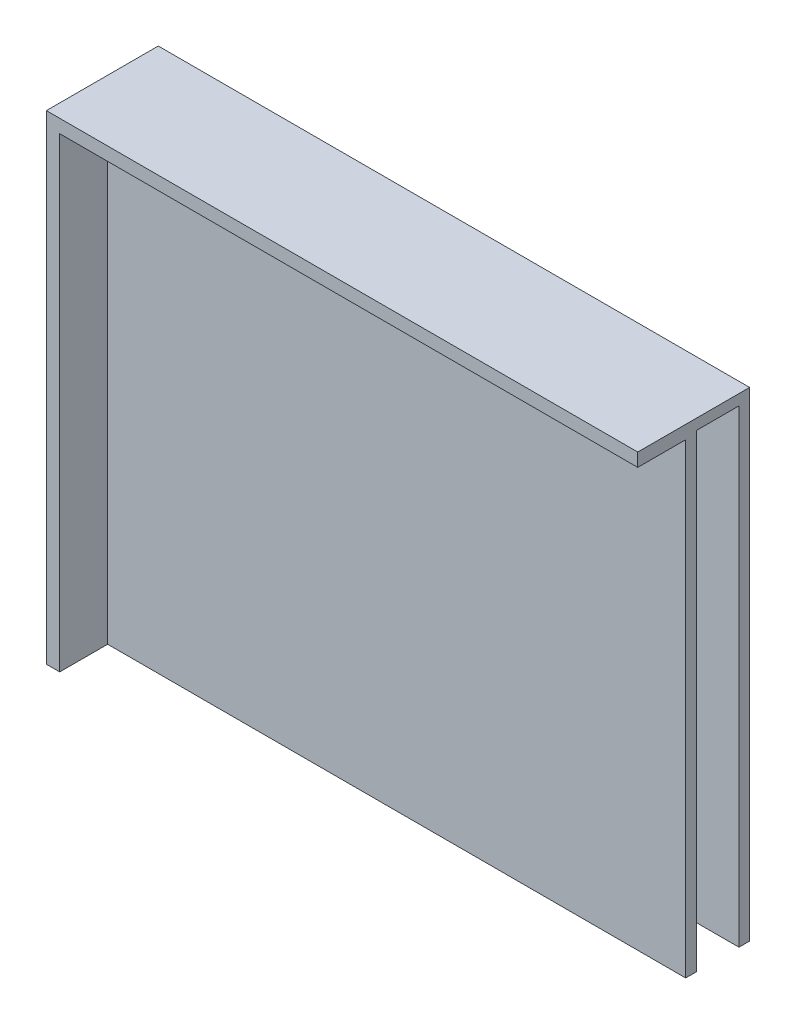
ISO-10303-21;
HEADER;
FILE_DESCRIPTION(('STEP AP214'),'2;1');
FILE_NAME('part.step','',(''),(''),'','','');
FILE_SCHEMA(('AUTOMOTIVE_DESIGN { 1 0 10303 214 1 1 1 1 }'));
ENDSEC;
DATA;
#1=APPLICATION_CONTEXT('core data for automotive mechanical design processes');
#2=APPLICATION_PROTOCOL_DEFINITION('international standard','automotive_design',2000,#1);
#3=PRODUCT_CONTEXT('',#1,'mechanical');
#4=PRODUCT('Part','Part','',(#3));
#5=PRODUCT_RELATED_PRODUCT_CATEGORY('part','',(#4));
#6=PRODUCT_DEFINITION_FORMATION('','',#4);
#7=PRODUCT_DEFINITION_CONTEXT('part definition',#1,'design');
#8=PRODUCT_DEFINITION('design','',#6,#7);
#9=PRODUCT_DEFINITION_SHAPE('','',#8);
#10=(LENGTH_UNIT() NAMED_UNIT(*) SI_UNIT(.MILLI.,.METRE.));
#11=(NAMED_UNIT(*) PLANE_ANGLE_UNIT() SI_UNIT($,.RADIAN.));
#12=(NAMED_UNIT(*) SI_UNIT($,.STERADIAN.) SOLID_ANGLE_UNIT());
#13=UNCERTAINTY_MEASURE_WITH_UNIT(LENGTH_MEASURE(1.E-05),#10,'distance_accuracy_value','');
#14=(GEOMETRIC_REPRESENTATION_CONTEXT(3) GLOBAL_UNCERTAINTY_ASSIGNED_CONTEXT((#13)) GLOBAL_UNIT_ASSIGNED_CONTEXT((#10,
#11,#12)) REPRESENTATION_CONTEXT('',''));
#15=CARTESIAN_POINT('',(0.,0.,0.));
#16=DIRECTION('',(0.,0.,1.));
#17=DIRECTION('',(1.,0.,0.));
#18=AXIS2_PLACEMENT_3D('',#15,#16,#17);
#19=CARTESIAN_POINT('',(72.6068292682926,16.3396341463416,26.68));
#20=DIRECTION('',(0.,-1.,0.));
#21=DIRECTION('',(1.,0.,0.));
#22=AXIS2_PLACEMENT_3D('',#19,#20,#21);
#23=PLANE('',#22);
#24=DIRECTION('',(-1.,0.,0.));
#25=VECTOR('',#24,1.);
#26=CARTESIAN_POINT('',(0.,16.3396341463416,12.7));
#27=LINE('',#26,#25);
#28=CARTESIAN_POINT('',(72.6068292682926,16.3396341463416,12.7));
#29=VERTEX_POINT('',#28);
#30=CARTESIAN_POINT('',(-65.8231707317073,16.3396341463416,12.7));
#31=VERTEX_POINT('',#30);
#32=EDGE_CURVE('E136',#29,#31,#27,.T.);
#33=ORIENTED_EDGE('',*,*,#32,.F.);
#34=DIRECTION('',(0.,0.,-1.));
#35=VECTOR('',#34,1.);
#36=CARTESIAN_POINT('',(72.6068292682926,16.3396341463416,26.68));
#37=LINE('',#36,#35);
#38=CARTESIAN_POINT('',(72.6068292682926,16.3396341463416,15.24));
#39=VERTEX_POINT('',#38);
#40=EDGE_CURVE('E137',#39,#29,#37,.T.);
#41=ORIENTED_EDGE('',*,*,#40,.F.);
#42=DIRECTION('',(-1.,0.,0.));
#43=VECTOR('',#42,1.);
#44=CARTESIAN_POINT('',(0.,16.3396341463416,15.24));
#45=LINE('',#44,#43);
#46=CARTESIAN_POINT('',(-65.1881707317074,16.3396341463416,15.24));
#47=VERTEX_POINT('',#46);
#48=EDGE_CURVE('E142',#39,#47,#45,.T.);
#49=ORIENTED_EDGE('',*,*,#48,.T.);
#50=DIRECTION('',(0.,0.,-1.));
#51=VECTOR('',#50,1.);
#52=CARTESIAN_POINT('',(-65.1881707317074,16.3396341463416,0.));
#53=LINE('',#52,#51);
#54=CARTESIAN_POINT('',(-65.1881707317074,16.3396341463416,26.67));
#55=VERTEX_POINT('',#54);
#56=EDGE_CURVE('E194',#55,#47,#53,.T.);
#57=ORIENTED_EDGE('',*,*,#56,.F.);
#58=DIRECTION('',(1.,0.,0.));
#59=VECTOR('',#58,1.);
#60=CARTESIAN_POINT('',(0.,16.3396341463416,26.67));
#61=LINE('',#60,#59);
#62=CARTESIAN_POINT('',(-68.3631707317074,16.3396341463416,26.67));
#63=VERTEX_POINT('',#62);
#64=EDGE_CURVE('E153',#63,#55,#61,.T.);
#65=ORIENTED_EDGE('',*,*,#64,.F.);
#66=DIRECTION('',(0.,0.,1.));
#67=VECTOR('',#66,1.);
#68=CARTESIAN_POINT('',(-68.3631707317073,16.3396341463416,17.272));
#69=LINE('',#68,#67);
#70=CARTESIAN_POINT('',(-68.3631707317074,16.3396341463416,0.));
#71=VERTEX_POINT('',#70);
#72=EDGE_CURVE('E141',#71,#63,#69,.T.);
#73=ORIENTED_EDGE('',*,*,#72,.F.);
#74=DIRECTION('',(1.,0.,0.));
#75=VECTOR('',#74,1.);
#76=CARTESIAN_POINT('',(0.,16.3396341463416,0.));
#77=LINE('',#76,#75);
#78=CARTESIAN_POINT('',(72.6068292682926,16.3396341463416,0.));
#79=VERTEX_POINT('',#78);
#80=EDGE_CURVE('E125',#71,#79,#77,.T.);
#81=ORIENTED_EDGE('',*,*,#80,.T.);
#82=CARTESIAN_POINT('',(72.6068292682926,16.3396341463416,2.54));
#83=VERTEX_POINT('',#82);
#84=EDGE_CURVE('E131',#83,#79,#37,.T.);
#85=ORIENTED_EDGE('',*,*,#84,.F.);
#86=DIRECTION('',(1.,0.,0.));
#87=VECTOR('',#86,1.);
#88=CARTESIAN_POINT('',(0.,16.3396341463416,2.54));
#89=LINE('',#88,#87);
#90=CARTESIAN_POINT('',(-65.8231707317073,16.3396341463416,2.54));
#91=VERTEX_POINT('',#90);
#92=EDGE_CURVE('E197',#91,#83,#89,.T.);
#93=ORIENTED_EDGE('',*,*,#92,.F.);
#94=DIRECTION('',(0.,0.,1.));
#95=VECTOR('',#94,1.);
#96=CARTESIAN_POINT('',(-65.8231707317073,16.3396341463416,17.272));
#97=LINE('',#96,#95);
#98=EDGE_CURVE('E145',#91,#31,#97,.T.);
#99=ORIENTED_EDGE('',*,*,#98,.T.);
#100=EDGE_LOOP('',(#33,#41,#49,#57,#65,#73,#81,#85,#93,#99));
#101=FACE_BOUND('',#100,.T.);
#102=ADVANCED_FACE('F40',(#101),#23,.T.);
#103=CARTESIAN_POINT('',(72.6068292682926,130.639634146342,26.68));
#104=DIRECTION('',(1.,0.,0.));
#105=DIRECTION('',(0.,1.,0.));
#106=AXIS2_PLACEMENT_3D('',#103,#104,#105);
#107=PLANE('',#106);
#108=DIRECTION('',(0.,-1.,0.));
#109=VECTOR('',#108,1.);
#110=CARTESIAN_POINT('',(72.6068292682926,0.,15.24));
#111=LINE('',#110,#109);
#112=CARTESIAN_POINT('',(72.6068292682926,127.464634146342,15.24));
#113=VERTEX_POINT('',#112);
#114=EDGE_CURVE('E11',#113,#39,#111,.T.);
#115=ORIENTED_EDGE('',*,*,#114,.T.);
#116=ORIENTED_EDGE('',*,*,#40,.T.);
#117=DIRECTION('',(0.,-1.,0.));
#118=VECTOR('',#117,1.);
#119=CARTESIAN_POINT('',(72.6068292682926,0.,12.7));
#120=LINE('',#119,#118);
#121=CARTESIAN_POINT('',(72.6068292682926,128.099634146342,12.7));
#122=VERTEX_POINT('',#121);
#123=EDGE_CURVE('E169',#122,#29,#120,.T.);
#124=ORIENTED_EDGE('',*,*,#123,.F.);
#125=DIRECTION('',(0.,0.,1.));
#126=VECTOR('',#125,1.);
#127=CARTESIAN_POINT('',(72.6068292682926,128.099634146342,25.4));
#128=LINE('',#127,#126);
#129=CARTESIAN_POINT('',(72.6068292682926,128.099634146342,2.54));
#130=VERTEX_POINT('',#129);
#131=EDGE_CURVE('E173',#130,#122,#128,.T.);
#132=ORIENTED_EDGE('',*,*,#131,.F.);
#133=DIRECTION('',(0.,1.,0.));
#134=VECTOR('',#133,1.);
#135=CARTESIAN_POINT('',(72.6068292682926,0.,2.54));
#136=LINE('',#135,#134);
#137=EDGE_CURVE('E134',#83,#130,#136,.T.);
#138=ORIENTED_EDGE('',*,*,#137,.F.);
#139=ORIENTED_EDGE('',*,*,#84,.T.);
#140=DIRECTION('',(0.,1.,0.));
#141=VECTOR('',#140,1.);
#142=CARTESIAN_POINT('',(72.6068292682926,0.,0.));
#143=LINE('',#142,#141);
#144=CARTESIAN_POINT('',(72.6068292682926,130.639634146342,0.));
#145=VERTEX_POINT('',#144);
#146=EDGE_CURVE('E48',#79,#145,#143,.T.);
#147=ORIENTED_EDGE('',*,*,#146,.T.);
#148=DIRECTION('',(0.,0.,1.));
#149=VECTOR('',#148,1.);
#150=CARTESIAN_POINT('',(72.6068292682926,130.639634146342,25.4));
#151=LINE('',#150,#149);
#152=CARTESIAN_POINT('',(72.6068292682926,130.639634146342,26.67));
#153=VERTEX_POINT('',#152);
#154=EDGE_CURVE('E128',#145,#153,#151,.T.);
#155=ORIENTED_EDGE('',*,*,#154,.T.);
#156=DIRECTION('',(0.,1.,0.));
#157=VECTOR('',#156,1.);
#158=CARTESIAN_POINT('',(72.6068292682926,0.,26.67));
#159=LINE('',#158,#157);
#160=CARTESIAN_POINT('',(72.6068292682926,127.464634146342,26.67));
#161=VERTEX_POINT('',#160);
#162=EDGE_CURVE('E176',#161,#153,#159,.T.);
#163=ORIENTED_EDGE('',*,*,#162,.F.);
#164=DIRECTION('',(0.,0.,1.));
#165=VECTOR('',#164,1.);
#166=CARTESIAN_POINT('',(72.6068292682926,127.464634146342,0.));
#167=LINE('',#166,#165);
#168=EDGE_CURVE('E182',#113,#161,#167,.T.);
#169=ORIENTED_EDGE('',*,*,#168,.F.);
#170=EDGE_LOOP('',(#115,#116,#124,#132,#138,#139,#147,#155,#163,#169));
#171=FACE_BOUND('',#170,.T.);
#172=ADVANCED_FACE('F132',(#171),#107,.T.);
#173=CARTESIAN_POINT('',(-65.8231707317073,-94.7853658536585,17.272));
#174=DIRECTION('',(-1.,0.,0.));
#175=DIRECTION('',(0.,0.,1.));
#176=AXIS2_PLACEMENT_3D('',#173,#174,#175);
#177=PLANE('',#176);
#178=ORIENTED_EDGE('',*,*,#98,.F.);
#179=DIRECTION('',(0.,-1.,0.));
#180=VECTOR('',#179,1.);
#181=CARTESIAN_POINT('',(-65.8231707317073,0.,2.54));
#182=LINE('',#181,#180);
#183=CARTESIAN_POINT('',(-65.8231707317073,128.099634146342,2.54));
#184=VERTEX_POINT('',#183);
#185=EDGE_CURVE('E165',#184,#91,#182,.T.);
#186=ORIENTED_EDGE('',*,*,#185,.F.);
#187=DIRECTION('',(0.,0.,-1.));
#188=VECTOR('',#187,1.);
#189=CARTESIAN_POINT('',(-65.8231707317073,128.099634146342,25.4));
#190=LINE('',#189,#188);
#191=CARTESIAN_POINT('',(-65.8231707317073,128.099634146342,12.7));
#192=VERTEX_POINT('',#191);
#193=EDGE_CURVE('E163',#192,#184,#190,.T.);
#194=ORIENTED_EDGE('',*,*,#193,.F.);
#195=DIRECTION('',(0.,1.,0.));
#196=VECTOR('',#195,1.);
#197=CARTESIAN_POINT('',(-65.8231707317073,0.,12.7));
#198=LINE('',#197,#196);
#199=EDGE_CURVE('E161',#31,#192,#198,.T.);
#200=ORIENTED_EDGE('',*,*,#199,.F.);
#201=EDGE_LOOP('',(#178,#186,#194,#200));
#202=FACE_BOUND('',#201,.T.);
#203=ADVANCED_FACE('F245',(#202),#177,.F.);
#204=CARTESIAN_POINT('',(0.,0.,12.7));
#205=DIRECTION('',(0.,0.,-1.));
#206=DIRECTION('',(-1.,0.,0.));
#207=AXIS2_PLACEMENT_3D('',#204,#205,#206);
#208=PLANE('',#207);
#209=ORIENTED_EDGE('',*,*,#123,.T.);
#210=ORIENTED_EDGE('',*,*,#32,.T.);
#211=ORIENTED_EDGE('',*,*,#199,.T.);
#212=DIRECTION('',(-1.,0.,0.));
#213=VECTOR('',#212,1.);
#214=CARTESIAN_POINT('',(0.,128.099634146342,12.7));
#215=LINE('',#214,#213);
#216=EDGE_CURVE('E172',#122,#192,#215,.T.);
#217=ORIENTED_EDGE('',*,*,#216,.F.);
#218=EDGE_LOOP('',(#209,#210,#211,#217));
#219=FACE_BOUND('',#218,.T.);
#220=ADVANCED_FACE('F42',(#219),#208,.T.);
#221=CARTESIAN_POINT('',(0.,0.,2.54));
#222=DIRECTION('',(0.,0.,1.));
#223=DIRECTION('',(1.,0.,0.));
#224=AXIS2_PLACEMENT_3D('',#221,#222,#223);
#225=PLANE('',#224);
#226=ORIENTED_EDGE('',*,*,#185,.T.);
#227=ORIENTED_EDGE('',*,*,#92,.T.);
#228=ORIENTED_EDGE('',*,*,#137,.T.);
#229=DIRECTION('',(-1.,0.,0.));
#230=VECTOR('',#229,1.);
#231=CARTESIAN_POINT('',(-68.3631707317074,128.099634146342,2.54));
#232=LINE('',#231,#230);
#233=EDGE_CURVE('E168',#130,#184,#232,.T.);
#234=ORIENTED_EDGE('',*,*,#233,.T.);
#235=EDGE_LOOP('',(#226,#227,#228,#234));
#236=FACE_BOUND('',#235,.T.);
#237=ADVANCED_FACE('F260',(#236),#225,.T.);
#238=CARTESIAN_POINT('',(-65.1881707317074,0.,0.));
#239=DIRECTION('',(1.,0.,0.));
#240=DIRECTION('',(0.,1.,0.));
#241=AXIS2_PLACEMENT_3D('',#238,#239,#240);
#242=PLANE('',#241);
#243=DIRECTION('',(0.,1.,0.));
#244=VECTOR('',#243,1.);
#245=CARTESIAN_POINT('',(-65.1881707317073,-80.4343658536585,26.67));
#246=LINE('',#245,#244);
#247=CARTESIAN_POINT('',(-65.1881707317074,127.464634146342,26.67));
#248=VERTEX_POINT('',#247);
#249=EDGE_CURVE('E152',#55,#248,#246,.T.);
#250=ORIENTED_EDGE('',*,*,#249,.F.);
#251=ORIENTED_EDGE('',*,*,#56,.T.);
#252=DIRECTION('',(0.,-1.,0.));
#253=VECTOR('',#252,1.);
#254=CARTESIAN_POINT('',(-65.1881707317073,-80.4343658536585,15.24));
#255=LINE('',#254,#253);
#256=CARTESIAN_POINT('',(-65.1881707317074,127.464634146342,15.24));
#257=VERTEX_POINT('',#256);
#258=EDGE_CURVE('E156',#257,#47,#255,.T.);
#259=ORIENTED_EDGE('',*,*,#258,.F.);
#260=DIRECTION('',(0.,0.,1.));
#261=VECTOR('',#260,1.);
#262=CARTESIAN_POINT('',(-65.1881707317074,127.464634146342,36.83));
#263=LINE('',#262,#261);
#264=EDGE_CURVE('E158',#257,#248,#263,.T.);
#265=ORIENTED_EDGE('',*,*,#264,.T.);
#266=EDGE_LOOP('',(#250,#251,#259,#265));
#267=FACE_BOUND('',#266,.T.);
#268=ADVANCED_FACE('F232',(#267),#242,.T.);
#269=CARTESIAN_POINT('',(-68.3631707317073,-94.7853658536585,17.272));
#270=DIRECTION('',(-1.,0.,0.));
#271=DIRECTION('',(0.,0.,1.));
#272=AXIS2_PLACEMENT_3D('',#269,#270,#271);
#273=PLANE('',#272);
#274=DIRECTION('',(0.,-1.,0.));
#275=VECTOR('',#274,1.);
#276=CARTESIAN_POINT('',(-68.3631707317074,130.639634146342,0.));
#277=LINE('',#276,#275);
#278=CARTESIAN_POINT('',(-68.3631707317074,130.639634146342,0.));
#279=VERTEX_POINT('',#278);
#280=EDGE_CURVE('E159',#279,#71,#277,.T.);
#281=ORIENTED_EDGE('',*,*,#280,.T.);
#282=ORIENTED_EDGE('',*,*,#72,.T.);
#283=DIRECTION('',(0.,-1.,0.));
#284=VECTOR('',#283,1.);
#285=CARTESIAN_POINT('',(-68.3631707317074,130.639634146342,26.67));
#286=LINE('',#285,#284);
#287=CARTESIAN_POINT('',(-68.3631707317074,130.639634146342,26.67));
#288=VERTEX_POINT('',#287);
#289=EDGE_CURVE('E149',#288,#63,#286,.T.);
#290=ORIENTED_EDGE('',*,*,#289,.F.);
#291=DIRECTION('',(0.,0.,-1.));
#292=VECTOR('',#291,1.);
#293=CARTESIAN_POINT('',(-68.3631707317074,130.639634146342,25.4));
#294=LINE('',#293,#292);
#295=EDGE_CURVE('E164',#288,#279,#294,.T.);
#296=ORIENTED_EDGE('',*,*,#295,.T.);
#297=EDGE_LOOP('',(#281,#282,#290,#296));
#298=FACE_BOUND('',#297,.T.);
#299=ADVANCED_FACE('F228',(#298),#273,.T.);
#300=CARTESIAN_POINT('',(0.,0.,26.67));
#301=DIRECTION('',(0.,0.,1.));
#302=DIRECTION('',(1.,0.,0.));
#303=AXIS2_PLACEMENT_3D('',#300,#301,#302);
#304=PLANE('',#303);
#305=ORIENTED_EDGE('',*,*,#289,.T.);
#306=ORIENTED_EDGE('',*,*,#64,.T.);
#307=ORIENTED_EDGE('',*,*,#249,.T.);
#308=DIRECTION('',(1.,0.,0.));
#309=VECTOR('',#308,1.);
#310=CARTESIAN_POINT('',(-65.1881707317074,127.464634146342,26.67));
#311=LINE('',#310,#309);
#312=EDGE_CURVE('E155',#248,#161,#311,.T.);
#313=ORIENTED_EDGE('',*,*,#312,.T.);
#314=ORIENTED_EDGE('',*,*,#162,.T.);
#315=DIRECTION('',(-1.,0.,0.));
#316=VECTOR('',#315,1.);
#317=CARTESIAN_POINT('',(213.576829268293,130.639634146342,26.67));
#318=LINE('',#317,#316);
#319=EDGE_CURVE('E218',#153,#288,#318,.T.);
#320=ORIENTED_EDGE('',*,*,#319,.T.);
#321=EDGE_LOOP('',(#305,#306,#307,#313,#314,#320));
#322=FACE_BOUND('',#321,.T.);
#323=ADVANCED_FACE('F216',(#322),#304,.T.);
#324=CARTESIAN_POINT('',(0.,0.,15.24));
#325=DIRECTION('',(0.,0.,-1.));
#326=DIRECTION('',(-1.,0.,0.));
#327=AXIS2_PLACEMENT_3D('',#324,#325,#326);
#328=PLANE('',#327);
#329=ORIENTED_EDGE('',*,*,#48,.F.);
#330=ORIENTED_EDGE('',*,*,#114,.F.);
#331=DIRECTION('',(-1.,0.,0.));
#332=VECTOR('',#331,1.);
#333=CARTESIAN_POINT('',(-65.1881707317074,127.464634146342,15.24));
#334=LINE('',#333,#332);
#335=EDGE_CURVE('E55',#113,#257,#334,.T.);
#336=ORIENTED_EDGE('',*,*,#335,.T.);
#337=ORIENTED_EDGE('',*,*,#258,.T.);
#338=EDGE_LOOP('',(#329,#330,#336,#337));
#339=FACE_BOUND('',#338,.T.);
#340=ADVANCED_FACE('F234',(#339),#328,.F.);
#341=CARTESIAN_POINT('',(0.,0.,0.));
#342=DIRECTION('',(0.,0.,1.));
#343=DIRECTION('',(1.,0.,0.));
#344=AXIS2_PLACEMENT_3D('',#341,#342,#343);
#345=PLANE('',#344);
#346=ORIENTED_EDGE('',*,*,#80,.F.);
#347=ORIENTED_EDGE('',*,*,#280,.F.);
#348=DIRECTION('',(-1.,0.,0.));
#349=VECTOR('',#348,1.);
#350=CARTESIAN_POINT('',(-68.3631707317074,130.639634146342,0.));
#351=LINE('',#350,#349);
#352=EDGE_CURVE('E126',#145,#279,#351,.T.);
#353=ORIENTED_EDGE('',*,*,#352,.F.);
#354=ORIENTED_EDGE('',*,*,#146,.F.);
#355=EDGE_LOOP('',(#346,#347,#353,#354));
#356=FACE_BOUND('',#355,.T.);
#357=ADVANCED_FACE('F122',(#356),#345,.F.);
#358=CARTESIAN_POINT('',(-68.3631707317074,128.099634146342,25.4));
#359=DIRECTION('',(0.,-1.,0.));
#360=DIRECTION('',(1.,0.,0.));
#361=AXIS2_PLACEMENT_3D('',#358,#359,#360);
#362=PLANE('',#361);
#363=ORIENTED_EDGE('',*,*,#233,.F.);
#364=ORIENTED_EDGE('',*,*,#131,.T.);
#365=ORIENTED_EDGE('',*,*,#216,.T.);
#366=ORIENTED_EDGE('',*,*,#193,.T.);
#367=EDGE_LOOP('',(#363,#364,#365,#366));
#368=FACE_BOUND('',#367,.T.);
#369=ADVANCED_FACE('F241',(#368),#362,.T.);
#370=CARTESIAN_POINT('',(-68.3631707317074,130.639634146342,25.4));
#371=DIRECTION('',(0.,-1.,0.));
#372=DIRECTION('',(1.,0.,0.));
#373=AXIS2_PLACEMENT_3D('',#370,#371,#372);
#374=PLANE('',#373);
#375=ORIENTED_EDGE('',*,*,#154,.F.);
#376=ORIENTED_EDGE('',*,*,#352,.T.);
#377=ORIENTED_EDGE('',*,*,#295,.F.);
#378=ORIENTED_EDGE('',*,*,#319,.F.);
#379=EDGE_LOOP('',(#375,#376,#377,#378));
#380=FACE_BOUND('',#379,.T.);
#381=ADVANCED_FACE('F224',(#380),#374,.F.);
#382=CARTESIAN_POINT('',(0.,127.464634146342,0.));
#383=DIRECTION('',(0.,-1.,0.));
#384=DIRECTION('',(1.,0.,0.));
#385=AXIS2_PLACEMENT_3D('',#382,#383,#384);
#386=PLANE('',#385);
#387=ORIENTED_EDGE('',*,*,#335,.F.);
#388=ORIENTED_EDGE('',*,*,#168,.T.);
#389=ORIENTED_EDGE('',*,*,#312,.F.);
#390=ORIENTED_EDGE('',*,*,#264,.F.);
#391=EDGE_LOOP('',(#387,#388,#389,#390));
#392=FACE_BOUND('',#391,.T.);
#393=ADVANCED_FACE('F214',(#392),#386,.T.);
#394=CLOSED_SHELL('',(#102,#172,#203,#220,#237,#268,#299,#323,#340,#357,#369,#381,#393));
#395=MANIFOLD_SOLID_BREP('B2',#394);
#396=ADVANCED_BREP_SHAPE_REPRESENTATION('',(#18,#395),#14);
#397=SHAPE_DEFINITION_REPRESENTATION(#9,#396);
ENDSEC;
END-ISO-10303-21;
